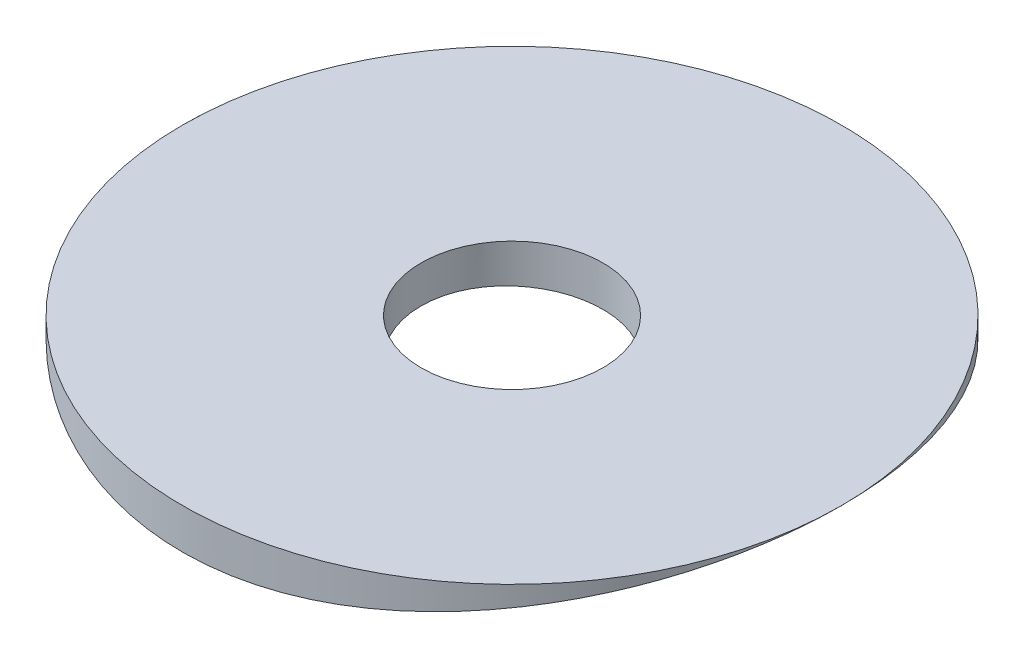
ISO-10303-21;
HEADER;
FILE_DESCRIPTION(('STEP AP214'),'2;1');
FILE_NAME('part.step','',(''),(''),'','','');
FILE_SCHEMA(('AUTOMOTIVE_DESIGN { 1 0 10303 214 1 1 1 1 }'));
ENDSEC;
DATA;
#1=APPLICATION_CONTEXT('core data for automotive mechanical design processes');
#2=APPLICATION_PROTOCOL_DEFINITION('international standard','automotive_design',2000,#1);
#3=PRODUCT_CONTEXT('',#1,'mechanical');
#4=PRODUCT('Part','Part','',(#3));
#5=PRODUCT_RELATED_PRODUCT_CATEGORY('part','',(#4));
#6=PRODUCT_DEFINITION_FORMATION('','',#4);
#7=PRODUCT_DEFINITION_CONTEXT('part definition',#1,'design');
#8=PRODUCT_DEFINITION('design','',#6,#7);
#9=PRODUCT_DEFINITION_SHAPE('','',#8);
#10=(LENGTH_UNIT() NAMED_UNIT(*) SI_UNIT(.MILLI.,.METRE.));
#11=(NAMED_UNIT(*) PLANE_ANGLE_UNIT() SI_UNIT($,.RADIAN.));
#12=(NAMED_UNIT(*) SI_UNIT($,.STERADIAN.) SOLID_ANGLE_UNIT());
#13=UNCERTAINTY_MEASURE_WITH_UNIT(LENGTH_MEASURE(1.E-05),#10,'distance_accuracy_value','');
#14=(GEOMETRIC_REPRESENTATION_CONTEXT(3) GLOBAL_UNCERTAINTY_ASSIGNED_CONTEXT((#13)) GLOBAL_UNIT_ASSIGNED_CONTEXT((#10,
#11,#12)) REPRESENTATION_CONTEXT('',''));
#15=CARTESIAN_POINT('',(0.,0.,0.));
#16=DIRECTION('',(0.,0.,1.));
#17=DIRECTION('',(1.,0.,0.));
#18=AXIS2_PLACEMENT_3D('',#15,#16,#17);
#19=CARTESIAN_POINT('',(-11.5062,-46.2795893867912,23.0124));
#20=DIRECTION('',(0.,-1.,0.));
#21=DIRECTION('',(0.,0.,-1.));
#22=AXIS2_PLACEMENT_3D('',#19,#20,#21);
#23=PLANE('',#22);
#24=CARTESIAN_POINT('',(0.,-46.2795893867912,11.5062));
#25=DIRECTION('',(0.,1.,0.));
#26=DIRECTION('',(0.,0.,1.));
#27=AXIS2_PLACEMENT_3D('',#24,#25,#26);
#28=CIRCLE('',#27,3.175);
#29=CARTESIAN_POINT('',(0.,-46.2795893867912,14.6812));
#30=VERTEX_POINT('',#29);
#31=EDGE_CURVE('E63',#30,#30,#28,.T.);
#32=ORIENTED_EDGE('',*,*,#31,.F.);
#33=EDGE_LOOP('',(#32));
#34=FACE_BOUND('',#33,.T.);
#35=CARTESIAN_POINT('',(0.,-46.2795893867912,11.5062));
#36=DIRECTION('',(0.,1.,0.));
#37=DIRECTION('',(0.,0.,1.));
#38=AXIS2_PLACEMENT_3D('',#35,#36,#37);
#39=CIRCLE('',#38,11.5062);
#40=CARTESIAN_POINT('',(11.5062,-46.2795893867912,11.5062));
#41=VERTEX_POINT('',#40);
#42=CARTESIAN_POINT('',(-11.5062,-46.2795893867912,11.5062));
#43=VERTEX_POINT('',#42);
#44=EDGE_CURVE('E61',#41,#43,#39,.T.);
#45=ORIENTED_EDGE('',*,*,#44,.T.);
#46=EDGE_CURVE('E59',#43,#41,#39,.T.);
#47=ORIENTED_EDGE('',*,*,#46,.T.);
#48=EDGE_LOOP('',(#45,#47));
#49=FACE_BOUND('',#48,.T.);
#50=ADVANCED_FACE('F34',(#34,#49),#23,.F.);
#51=CARTESIAN_POINT('',(0.,-48.8195893867912,11.5062));
#52=DIRECTION('',(0.,1.,0.));
#53=DIRECTION('',(0.,0.,1.));
#54=AXIS2_PLACEMENT_3D('',#51,#52,#53);
#55=CYLINDRICAL_SURFACE('',#54,11.5062);
#56=CARTESIAN_POINT('',(0.,-47.6885,23.0124));
#57=CARTESIAN_POINT('',(0.318246732890627,-47.6884992204809,23.0123985676349));
#58=CARTESIAN_POINT('',(0.636522870128798,-47.6853063120302,22.9991853835495));
#59=CARTESIAN_POINT('',(1.2707825730018,-47.6726210718855,22.9464381079868));
#60=CARTESIAN_POINT('',(1.5867658480226,-47.6631279552842,22.9069007369262));
#61=CARTESIAN_POINT('',(2.21430394956169,-47.638099725689,22.8018078214636));
#62=CARTESIAN_POINT('',(2.52585637579411,-47.6225614581458,22.7362386925078));
#63=CARTESIAN_POINT('',(3.14215313475069,-47.5858719770836,22.5796189306647));
#64=CARTESIAN_POINT('',(3.44689731522977,-47.5647206381818,22.4885677285654));
#65=CARTESIAN_POINT('',(4.0470980682431,-47.5174131320405,22.2818328020855));
#66=CARTESIAN_POINT('',(4.3425652905622,-47.4912629676698,22.166178603749));
#67=CARTESIAN_POINT('',(4.9226005827476,-47.43464935526,21.9110559576735));
#68=CARTESIAN_POINT('',(5.20716858701688,-47.4041858812664,21.7715873666348));
#69=CARTESIAN_POINT('',(5.76348507995101,-47.3397684753857,21.469883592819));
#70=CARTESIAN_POINT('',(6.03523579036861,-47.305815151698,21.3076523752435));
#71=CARTESIAN_POINT('',(6.56431054397245,-47.2353058549203,20.9614863398665));
#72=CARTESIAN_POINT('',(6.82162977460299,-47.1987490227387,20.7775443447765));
#73=CARTESIAN_POINT('',(7.3243912778399,-47.1233705270856,20.3859071791165));
#74=CARTESIAN_POINT('',(7.56955428594153,-47.0845207792537,20.1778588346667));
#75=CARTESIAN_POINT('',(8.04156734729821,-47.0062067679489,19.742037582966));
#76=CARTESIAN_POINT('',(8.26841720353517,-46.9667424978701,19.514264463565));
#77=CARTESIAN_POINT('',(8.70236959779166,-46.8882761451119,19.0404310268405));
#78=CARTESIAN_POINT('',(8.9094666161072,-46.849274194273,18.794365631932));
#79=CARTESIAN_POINT('',(9.30237827348639,-46.7728430362195,18.285701533935));
#80=CARTESIAN_POINT('',(9.48820031852416,-46.7354132846012,18.0231086338254));
#81=CARTESIAN_POINT('',(9.83979101009474,-46.6626642479904,17.4792603382703));
#82=CARTESIAN_POINT('',(10.0052439860227,-46.6273816584643,17.1977958081674));
#83=CARTESIAN_POINT('',(10.3117975603252,-46.5605464857226,16.6214712940022));
#84=CARTESIAN_POINT('',(10.4528978741261,-46.528993946096,16.3266111534561));
#85=CARTESIAN_POINT('',(10.7096289137982,-46.4705737354125,15.7255904877546));
#86=CARTESIAN_POINT('',(10.8252625697344,-46.4437055254747,15.4194312673516));
#87=CARTESIAN_POINT('',(11.0301333046154,-46.3954769363438,14.7979826074268));
#88=CARTESIAN_POINT('',(11.1193709694459,-46.3741164349029,14.4826933707253));
#89=CARTESIAN_POINT('',(11.2692729611225,-46.3379148981606,13.8512866861915));
#90=CARTESIAN_POINT('',(11.3304413451078,-46.3229592050334,13.5352954505988));
#91=CARTESIAN_POINT('',(11.4261124725001,-46.2994537809721,12.8990648218805));
#92=CARTESIAN_POINT('',(11.4606155179418,-46.2909039774795,12.5788254769144));
#93=CARTESIAN_POINT('',(11.5026534678221,-46.280476084,11.9365153898507));
#94=CARTESIAN_POINT('',(11.5101919271719,-46.2785971145551,11.6144448947731));
#95=CARTESIAN_POINT('',(11.4982440398491,-46.2815671212431,10.9708390652864));
#96=CARTESIAN_POINT('',(11.4787580391988,-46.2864160112321,10.649303724078));
#97=CARTESIAN_POINT('',(11.4136748703773,-46.3025068985088,10.016370616729));
#98=CARTESIAN_POINT('',(11.3686748601171,-46.3136026471218,9.70490749902797));
#99=CARTESIAN_POINT('',(11.2533897136348,-46.3417497261994,9.08697734508782));
#100=CARTESIAN_POINT('',(11.1831050133746,-46.3588009539787,8.78051022280235));
#101=CARTESIAN_POINT('',(11.0178100394477,-46.3983631888328,8.17466891463673));
#102=CARTESIAN_POINT('',(10.9227986322931,-46.4208744461954,7.87529505460277));
#103=CARTESIAN_POINT('',(10.7087851942922,-46.4707113415137,7.28566336352624));
#104=CARTESIAN_POINT('',(10.5897828097521,-46.498037050447,6.99540566695418));
#105=CARTESIAN_POINT('',(10.3274317045344,-46.557012610316,6.42320991117423));
#106=CARTESIAN_POINT('',(10.1838631392361,-46.5887009528833,6.1413766426483));
#107=CARTESIAN_POINT('',(9.87421224707139,-46.6553108698528,5.59076779476638));
#108=CARTESIAN_POINT('',(9.70812984095901,-46.6902324556356,5.32199226137658));
#109=CARTESIAN_POINT('',(9.3545741165693,-46.7623514945933,4.79917538520898));
#110=CARTESIAN_POINT('',(9.16709809941159,-46.799549234638,4.54513590754807));
#111=CARTESIAN_POINT('',(8.77201086233625,-46.8752098985855,4.05341924040186));
#112=CARTESIAN_POINT('',(8.56439884531765,-46.9136728725338,3.81574269929488));
#113=CARTESIAN_POINT('',(8.12462470957052,-46.9918576094258,3.35219088072147));
#114=CARTESIAN_POINT('',(7.89195777409035,-47.031585717663,3.12679530740406));
#115=CARTESIAN_POINT('',(7.40836896061007,-47.1101804162462,2.69634771122777));
#116=CARTESIAN_POINT('',(7.15744675041914,-47.1490469908981,2.49129605872732));
#117=CARTESIAN_POINT('',(6.63899973684026,-47.22483813314,2.1029439331515));
#118=CARTESIAN_POINT('',(6.37147409840131,-47.2617626028812,1.91964455543496));
#119=CARTESIAN_POINT('',(5.82162878720429,-47.3326366553632,1.57612674539369));
#120=CARTESIAN_POINT('',(5.53930966095149,-47.3665863478756,1.41590746125616));
#121=CARTESIAN_POINT('',(4.96089851875993,-47.4306591705903,1.11928123169031));
#122=CARTESIAN_POINT('',(4.66476690110639,-47.4607702400527,0.982948858535656));
#123=CARTESIAN_POINT('',(4.0616101251198,-47.5161873496509,0.735769032535113));
#124=CARTESIAN_POINT('',(3.75458491120954,-47.5414933652681,0.624921709731015));
#125=CARTESIAN_POINT('',(3.13189659427401,-47.5865703255751,0.429633991707477));
#126=CARTESIAN_POINT('',(2.81623474855201,-47.6063420712756,0.345189774788329));
#127=CARTESIAN_POINT('',(2.17856508810096,-47.6397817532279,0.203405374918164));
#128=CARTESIAN_POINT('',(1.85655741861773,-47.6534498290138,0.146064572361938));
#129=CARTESIAN_POINT('',(1.21638665838498,-47.6740341595147,0.0600286352011383));
#130=CARTESIAN_POINT('',(0.898316147451562,-47.6811042555896,0.0306804326481103));
#131=CARTESIAN_POINT('',(0.260760575955906,-47.688852597444,-0.00147200626102542));
#132=CARTESIAN_POINT('',(-0.0587244619615724,-47.6895309451797,-0.00427666601900739));
#133=CARTESIAN_POINT('',(-0.696744873146373,-47.684477018652,0.0166805824528598));
#134=CARTESIAN_POINT('',(-1.01528031774418,-47.6787452387183,0.0404404421074679));
#135=CARTESIAN_POINT('',(-1.64910157867821,-47.6610323890382,0.114321384406101));
#136=CARTESIAN_POINT('',(-1.96438740637002,-47.6490513411371,0.164442374900823));
#137=CARTESIAN_POINT('',(-2.58514829611967,-47.6193792741518,0.289759611795546));
#138=CARTESIAN_POINT('',(-2.890698594469,-47.601768755151,0.364602811548358));
#139=CARTESIAN_POINT('',(-3.49432159982125,-47.5612684290336,0.538928586044518));
#140=CARTESIAN_POINT('',(-3.7923943960775,-47.5383786849644,0.638410866535373));
#141=CARTESIAN_POINT('',(-4.37908027566311,-47.4879288869412,0.861259054479426));
#142=CARTESIAN_POINT('',(-4.66769281931577,-47.4603685670974,0.984626321730453));
#143=CARTESIAN_POINT('',(-5.23356431721944,-47.4013056544813,1.25433725391317));
#144=CARTESIAN_POINT('',(-5.51082275214771,-47.3698028816527,1.40068196832793));
#145=CARTESIAN_POINT('',(-6.05674238191884,-47.3031266546319,1.71794970817582));
#146=CARTESIAN_POINT('',(-6.32518172832548,-47.2679005467852,1.8892434234605));
#147=CARTESIAN_POINT('',(-6.84674398695382,-47.1951742599981,2.25331485194512));
#148=CARTESIAN_POINT('',(-7.09986675763358,-47.1576740600491,2.4460927636358));
#149=CARTESIAN_POINT('',(-7.58921288089649,-47.0813999403051,2.85186417044919));
#150=CARTESIAN_POINT('',(-7.82543366041192,-47.0426258278821,3.06486073211512));
#151=CARTESIAN_POINT('',(-8.27941698968223,-46.9648521435315,3.50964587188922));
#152=CARTESIAN_POINT('',(-8.49717974174613,-46.92585257408,3.74143424397546));
#153=CARTESIAN_POINT('',(-8.91757925203087,-46.8478021586205,4.22780202036676));
#154=CARTESIAN_POINT('',(-9.11975827268612,-46.8087703938261,4.48278040295745));
#155=CARTESIAN_POINT('',(-9.50192900495535,-46.7326904240134,5.00914191710173));
#156=CARTESIAN_POINT('',(-9.68192034034236,-46.6956422526361,5.28052532671198));
#157=CARTESIAN_POINT('',(-10.0184103909501,-46.6246079525053,5.83786261516889));
#158=CARTESIAN_POINT('',(-10.1749096907656,-46.5906217475638,6.12381613120392));
#159=CARTESIAN_POINT('',(-10.4632387249786,-46.5267179855457,6.70833909129557));
#160=CARTESIAN_POINT('',(-10.5950687860983,-46.4968003745855,7.00690836820343));
#161=CARTESIAN_POINT('',(-10.8323074675025,-46.4421025470368,7.6127504540477));
#162=CARTESIAN_POINT('',(-10.9378694238564,-46.4172926690481,7.91996051412858));
#163=CARTESIAN_POINT('',(-11.1227281429186,-46.3733435180157,8.54258538392218));
#164=CARTESIAN_POINT('',(-11.2020249468674,-46.3542042360683,8.85800018075136));
#165=CARTESIAN_POINT('',(-11.3336673730964,-46.3221935179297,9.49466533934258));
#166=CARTESIAN_POINT('',(-11.3860175419981,-46.3093210243828,9.81591470717963));
#167=CARTESIAN_POINT('',(-11.463326553472,-46.2902448677587,10.4618869371061));
#168=CARTESIAN_POINT('',(-11.4882860005265,-46.2840410575112,10.7866097223813));
#169=CARTESIAN_POINT('',(-11.5102951239893,-46.278572322594,11.4283598238556));
#170=CARTESIAN_POINT('',(-11.5080729163413,-46.2791263737019,11.7453608564997));
#171=CARTESIAN_POINT('',(-11.477493891953,-46.2867196360727,12.378017208797));
#172=CARTESIAN_POINT('',(-11.4491375671776,-46.2937587252572,12.69367255367));
#173=CARTESIAN_POINT('',(-11.3665313218254,-46.3141101744625,13.3213607751441));
#174=CARTESIAN_POINT('',(-11.3122820212848,-46.3274223842664,13.6333937383039));
#175=CARTESIAN_POINT('',(-11.1783390062078,-46.35992354171,14.2516358964751));
#176=CARTESIAN_POINT('',(-11.0986451663744,-46.3791125182887,14.5578450628004));
#177=CARTESIAN_POINT('',(-10.9149317970956,-46.4226900430481,15.1607450393376));
#178=CARTESIAN_POINT('',(-10.811040696806,-46.4470510816679,15.4574770098489));
#179=CARTESIAN_POINT('',(-10.5795054958695,-46.500335447385,16.0410933477976));
#180=CARTESIAN_POINT('',(-10.4518615472515,-46.5292587452817,16.3279777782497));
#181=CARTESIAN_POINT('',(-10.1737639617234,-46.5908556305375,16.8900151062371));
#182=CARTESIAN_POINT('',(-10.0233121909528,-46.6235289110194,17.1651689612123));
#183=CARTESIAN_POINT('',(-9.70058152391568,-46.6917439317793,17.7021275166934));
#184=CARTESIAN_POINT('',(-9.52829431753712,-46.7272867622691,17.9639270813524));
#185=CARTESIAN_POINT('',(-9.15870480356707,-46.80114855133,18.4785389600204));
#186=CARTESIAN_POINT('',(-8.96090152609513,-46.8395136543902,18.730984983082));
#187=CARTESIAN_POINT('',(-8.54490823163081,-46.9171861260871,19.2185224514448));
#188=CARTESIAN_POINT('',(-8.32670893680021,-46.9564939174349,19.4536059108841));
#189=CARTESIAN_POINT('',(-7.8713864995668,-47.0349622540427,19.9048106680596));
#190=CARTESIAN_POINT('',(-7.63425898743135,-47.0741227631037,20.1209275628936));
#191=CARTESIAN_POINT('',(-7.1427809902973,-47.1511987726748,20.5326074140969));
#192=CARTESIAN_POINT('',(-6.88843824358761,-47.1891148213405,20.728179505832));
#193=CARTESIAN_POINT('',(-6.35962334272006,-47.2633124260529,21.100687951953));
#194=CARTESIAN_POINT('',(-6.08488234154635,-47.2995551992281,21.2772506432863));
#195=CARTESIAN_POINT('',(-5.52117136220328,-47.368663577994,21.6064872886053));
#196=CARTESIAN_POINT('',(-5.2322067437304,-47.4015304414899,21.7591701516719));
#197=CARTESIAN_POINT('',(-4.64209950173224,-47.462952929223,22.0394904535701));
#198=CARTESIAN_POINT('',(-4.34096259027358,-47.4915105465445,22.1671394791246));
#199=CARTESIAN_POINT('',(-3.72855069298149,-47.5435097585458,22.3964439951481));
#200=CARTESIAN_POINT('',(-3.41727732777305,-47.5669521664792,22.4981036180455));
#201=CARTESIAN_POINT('',(-2.85033516676566,-47.6039108816255,22.6568326129536));
#202=CARTESIAN_POINT('',(-2.59608167455876,-47.6184753530549,22.7187583290157));
#203=CARTESIAN_POINT('',(-2.08376286882057,-47.6436429524579,22.8251664487699));
#204=CARTESIAN_POINT('',(-1.82569782815735,-47.6542463625879,22.8696500949161));
#205=CARTESIAN_POINT('',(-1.30697298065937,-47.6712932509188,22.9409280639691));
#206=CARTESIAN_POINT('',(-1.04631291721982,-47.677736313497,22.967720619525));
#207=CARTESIAN_POINT('',(-0.523774998018724,-47.6863394851684,23.0034549945511));
#208=CARTESIAN_POINT('',(-0.261897455727261,-47.6885006414962,23.0124011787482));
#209=CARTESIAN_POINT('',(0.,-47.6885,23.0124));
#210=B_SPLINE_CURVE_WITH_KNOTS('',3,(#56,#57,#58,#59,#60,#61,#62,#63,#64,#65,#66,#67,#68,#69,
#70,#71,#72,#73,#74,#75,#76,#77,#78,#79,#80,#81,#82,#83,#84,#85,#86,#87,#88,#89,#90,#91,#92,#93,
#94,#95,#96,#97,#98,#99,#100,#101,#102,#103,#104,#105,#106,#107,#108,#109,#110,#111,#112,#113,
#114,#115,#116,#117,#118,#119,#120,#121,#122,#123,#124,#125,#126,#127,#128,#129,#130,#131,#132,
#133,#134,#135,#136,#137,#138,#139,#140,#141,#142,#143,#144,#145,#146,#147,#148,#149,#150,#151,
#152,#153,#154,#155,#156,#157,#158,#159,#160,#161,#162,#163,#164,#165,#166,#167,#168,#169,#170,
#171,#172,#173,#174,#175,#176,#177,#178,#179,#180,#181,#182,#183,#184,#185,#186,#187,#188,#189,
#190,#191,#192,#193,#194,#195,#196,#197,#198,#199,#200,#201,#202,#203,#204,#205,#206,#207,#208,
#209),.UNSPECIFIED.,.T.,.F.,(4,2,2,2,2,2,2,2,2,2,2,2,2,2,2,2,2,2,2,2,2,2,2,2,2,2,2,2,2,2,2,2,2,
2,2,2,2,2,2,2,2,2,2,2,2,2,2,2,2,2,2,2,2,2,2,2,2,2,2,2,2,2,2,2,2,2,2,2,2,2,2,2,2,2,2,2,4),(0.,
0.954501893226166,1.90912272476295,2.86424237700186,3.81938336616228,4.77338449327135,
5.72739136114187,6.68123224887051,7.63538935132315,8.60590523797059,9.57643156431278,
10.5472283033895,11.5176860668443,12.5016726507291,13.4856707322319,14.4695555406716,
15.4534185091552,16.4188465395074,17.3842636344253,18.3495534476297,19.3148309013353,
20.2583970571072,21.2019469445707,22.1455400925766,23.0891471527839,24.0416883377546,
24.9942328756441,25.9468977135502,26.8996002789226,27.8775518953703,28.8555213120341,
29.8335399545054,30.8115224921683,31.7925057932145,32.7734940997833,33.7543403480597,
34.7351641723408,35.6925012413669,36.6498230396737,37.6070710173162,38.5643156487763,
39.5084421043505,40.4525572852277,41.396726231405,42.3409383145643,43.3009689245638,
44.2610084049442,45.2211937269521,46.1813685234978,47.1634223941355,48.1454929147449,
49.1275389926611,50.1095720633288,51.0857305939933,52.0618875919308,53.0378798319186,
54.0138505324281,54.9637364328658,55.9136044524274,56.8634497274836,57.8132996799507,
58.7582186957465,59.7031316638485,60.6479673607124,61.5931637282696,62.5610360537939,
63.5293508123764,64.4978897644134,65.4659962106313,66.4505732984387,67.4347821796931,
68.4185344465945,69.40213019517,70.1877961373962,70.9734061039744,71.7590945416053,
72.5445907980859),.UNSPECIFIED.);
#211=EDGE_CURVE('E47',#41,#43,#210,.T.);
#212=ORIENTED_EDGE('',*,*,#211,.T.);
#213=ORIENTED_EDGE('',*,*,#44,.F.);
#214=EDGE_LOOP('',(#212,#213));
#215=FACE_BOUND('',#214,.T.);
#216=ADVANCED_FACE('F67',(#215),#55,.T.);
#217=ORIENTED_EDGE('',*,*,#46,.F.);
#218=EDGE_CURVE('E53',#43,#41,#210,.T.);
#219=ORIENTED_EDGE('',*,*,#218,.T.);
#220=EDGE_LOOP('',(#217,#219));
#221=FACE_BOUND('',#220,.T.);
#222=ADVANCED_FACE('F65',(#221),#55,.T.);
#223=CARTESIAN_POINT('',(0.,0.,23.0124));
#224=DIRECTION('',(0.,0.,-1.));
#225=DIRECTION('',(-1.,0.,0.));
#226=AXIS2_PLACEMENT_3D('',#223,#224,#225);
#227=CYLINDRICAL_SURFACE('',#226,47.6885);
#228=CARTESIAN_POINT('',(0.,-47.6885,14.6812));
#229=CARTESIAN_POINT('',(0.178129464682201,-47.6884985983923,14.6811921716468));
#230=CARTESIAN_POINT('',(0.356383055368182,-47.6874912896571,14.6661590167554));
#231=CARTESIAN_POINT('',(0.707966529549292,-47.6835697779981,14.606405524357));
#232=CARTESIAN_POINT('',(0.881290465814657,-47.6806533659057,14.5616507928849));
#233=CARTESIAN_POINT('',(1.21787115352155,-47.6732435104109,14.4437468309556));
#234=CARTESIAN_POINT('',(1.3811332286456,-47.668750909532,14.370612767951));
#235=CARTESIAN_POINT('',(1.69302205967912,-47.6586937129271,14.1980511982679));
#236=CARTESIAN_POINT('',(1.84165211843303,-47.6531293599671,14.0986296441535));
#237=CARTESIAN_POINT('',(2.12034963580226,-47.641543477738,13.8761329145368));
#238=CARTESIAN_POINT('',(2.25038922987499,-47.6355212824979,13.7530228679073));
#239=CARTESIAN_POINT('',(2.48797599458251,-47.6237041187203,13.4867161295903));
#240=CARTESIAN_POINT('',(2.59552221724273,-47.617909159768,13.3435185917479));
#241=CARTESIAN_POINT('',(2.78515732340433,-47.6071947611636,13.0409412692604));
#242=CARTESIAN_POINT('',(2.86722273426711,-47.6022761305421,12.8815467424374));
#243=CARTESIAN_POINT('',(3.00341655627266,-47.5938778009991,12.5512032984433));
#244=CARTESIAN_POINT('',(3.05754530111357,-47.5903980848901,12.3802545193132));
#245=CARTESIAN_POINT('',(3.13625108129015,-47.5852764087903,12.0319263367162));
#246=CARTESIAN_POINT('',(3.16087220734742,-47.5836317071483,11.8545569366411));
#247=CARTESIAN_POINT('',(3.17999997354824,-47.5823573280138,11.4981958003257));
#248=CARTESIAN_POINT('',(3.17450699351589,-47.5827276251066,11.3192040845758));
#249=CARTESIAN_POINT('',(3.13359902998388,-47.5854389403397,10.9649799618099));
#250=CARTESIAN_POINT('',(3.09823179308924,-47.5877768137745,10.7897420133066));
#251=CARTESIAN_POINT('',(2.99865334204147,-47.5941548786142,10.4476955507445));
#252=CARTESIAN_POINT('',(2.93444193608422,-47.598195081339,10.2808870927472));
#253=CARTESIAN_POINT('',(2.77894379778638,-47.6075261354621,9.96028150644429));
#254=CARTESIAN_POINT('',(2.6876354473883,-47.6128179847425,9.80649489341426));
#255=CARTESIAN_POINT('',(2.48055097848701,-47.6240550114686,9.51641339804095));
#256=CARTESIAN_POINT('',(2.3647745466401,-47.6300001972806,9.38011873973947));
#257=CARTESIAN_POINT('',(2.11177166044706,-47.6418879070646,9.12861229218023));
#258=CARTESIAN_POINT('',(1.97450389212058,-47.6478304033296,9.01344205730632));
#259=CARTESIAN_POINT('',(1.68255957192209,-47.659031972027,8.80777437630301));
#260=CARTESIAN_POINT('',(1.52788301316935,-47.6642910441893,8.71727693992547));
#261=CARTESIAN_POINT('',(1.20548629424639,-47.6735336699595,8.56352710176391));
#262=CARTESIAN_POINT('',(1.03776535916176,-47.6775171477174,8.50027632005674));
#263=CARTESIAN_POINT('',(0.694052323587685,-47.6837587273361,8.40284323837389));
#264=CARTESIAN_POINT('',(0.518060332717272,-47.6860168520568,8.36866055326371));
#265=CARTESIAN_POINT('',(0.163161430090162,-47.6885503346571,8.33038558166807));
#266=CARTESIAN_POINT('',(-0.0157392607318615,-47.688829477656,8.32623585203226));
#267=CARTESIAN_POINT('',(-0.371694109039901,-47.6873836175604,8.34799442919318));
#268=CARTESIAN_POINT('',(-0.548748277443507,-47.6856586263223,8.37390255817066));
#269=CARTESIAN_POINT('',(-0.895822000148099,-47.680401089412,8.45499384454233));
#270=CARTESIAN_POINT('',(-1.06584774984863,-47.6768701740015,8.51015059997761));
#271=CARTESIAN_POINT('',(-1.39422956926831,-47.6683979235374,8.64814660078975));
#272=CARTESIAN_POINT('',(-1.55258552002274,-47.663456574108,8.73098612832374));
#273=CARTESIAN_POINT('',(-1.85339536716782,-47.6527090188861,8.92214206772992));
#274=CARTESIAN_POINT('',(-1.9958248708315,-47.6469015174124,9.03049679093437));
#275=CARTESIAN_POINT('',(-2.26049310024045,-47.6350793937232,9.26955163801912));
#276=CARTESIAN_POINT('',(-2.3827316010535,-47.6290647692012,9.40025201080184));
#277=CARTESIAN_POINT('',(-2.60374293655754,-47.6174952780448,9.68053613619416));
#278=CARTESIAN_POINT('',(-2.70247846655846,-47.6119411513129,9.83014933923933));
#279=CARTESIAN_POINT('',(-2.87342584298463,-47.6019308430942,10.143864389921));
#280=CARTESIAN_POINT('',(-2.94563787078409,-47.5974746540995,10.3079661384717));
#281=CARTESIAN_POINT('',(-3.0614239903229,-47.5901681193181,10.6458644993966));
#282=CARTESIAN_POINT('',(-3.10502144969201,-47.5873164634872,10.8196530750204));
#283=CARTESIAN_POINT('',(-3.16241713776624,-47.5835369665715,11.1721032298247));
#284=CARTESIAN_POINT('',(-3.1762157098313,-47.5826091033195,11.3507647528324));
#285=CARTESIAN_POINT('',(-3.1736185286523,-47.582782369364,11.7075183818366));
#286=CARTESIAN_POINT('',(-3.15728141593345,-47.5838795581481,11.8856109196147));
#287=CARTESIAN_POINT('',(-3.09499831740002,-47.5879709396778,12.2365179374258));
#288=CARTESIAN_POINT('',(-3.04905227916865,-47.5909651357817,12.4093324081144));
#289=CARTESIAN_POINT('',(-2.92886909637586,-47.5985121452103,12.7447856003532));
#290=CARTESIAN_POINT('',(-2.8546323516317,-47.6030649365082,12.9074244656719));
#291=CARTESIAN_POINT('',(-2.67998274398894,-47.6132160494497,13.2179380691714));
#292=CARTESIAN_POINT('',(-2.57957051252143,-47.6188143458718,13.3658131633796));
#293=CARTESIAN_POINT('',(-2.35520235144463,-47.6304383844963,13.6428997487939));
#294=CARTESIAN_POINT('',(-2.2312037455711,-47.6364648889046,13.7720766504064));
#295=CARTESIAN_POINT('',(-1.96324542168783,-47.6482596222419,14.007827537614));
#296=CARTESIAN_POINT('',(-1.8192808369697,-47.6540277877459,14.11439599633));
#297=CARTESIAN_POINT('',(-1.51529393734399,-47.6646626148929,14.3019943041698));
#298=CARTESIAN_POINT('',(-1.35525031212904,-47.6695280551527,14.3829896554164));
#299=CARTESIAN_POINT('',(-1.02391832072713,-47.6777932805234,14.5168594305982));
#300=CARTESIAN_POINT('',(-0.852643345958599,-47.6811947757914,14.569766683576));
#301=CARTESIAN_POINT('',(-0.566939025973481,-47.6852606029892,14.6322551502534));
#302=CARTESIAN_POINT('',(-0.454354934409848,-47.6864699555018,14.6505856215218));
#303=CARTESIAN_POINT('',(-0.227864161010604,-47.6880901017082,14.675060540782));
#304=CARTESIAN_POINT('',(-0.113957481278454,-47.6885008966719,14.6812050081519));
#305=CARTESIAN_POINT('',(0.,-47.6885,14.6812));
#306=B_SPLINE_CURVE_WITH_KNOTS('',3,(#228,#229,#230,#231,#232,#233,#234,#235,#236,#237,#238,
#239,#240,#241,#242,#243,#244,#245,#246,#247,#248,#249,#250,#251,#252,#253,#254,#255,#256,#257,
#258,#259,#260,#261,#262,#263,#264,#265,#266,#267,#268,#269,#270,#271,#272,#273,#274,#275,#276,
#277,#278,#279,#280,#281,#282,#283,#284,#285,#286,#287,#288,#289,#290,#291,#292,#293,#294,#295,
#296,#297,#298,#299,#300,#301,#302,#303,#304,#305),.UNSPECIFIED.,.T.,.F.,(4,2,2,2,2,2,2,2,2,2,2,
2,2,2,2,2,2,2,2,2,2,2,2,2,2,2,2,2,2,2,2,2,2,2,2,2,2,2,4),(0.,0.533972371921444,1.06856373873181,
1.60286978358999,2.13705494314778,2.67203256145305,3.20703272164504,3.74252426576325,
4.27800941338903,4.81269342958934,5.34737070192683,5.88119503837625,6.41502292463221,
6.94927785126184,7.48353962009351,8.01884133384741,8.55414325917763,9.08947700898706,
9.62480366584112,10.1591061478901,10.6934054690755,11.2272233113874,11.7610465948128,
12.2956765887545,12.83031253819,13.3657915039746,13.9012668079546,14.436304278697,
14.9713355843967,15.5053268797068,16.0393191203463,16.5733038146421,17.1072756288207,
17.642222942613,18.1773008797679,18.7130975781012,19.2482666570688,19.5898734959414,
19.9314797915928),.UNSPECIFIED.);
#307=CARTESIAN_POINT('',(0.,-47.6885,14.6812));
#308=VERTEX_POINT('',#307);
#309=EDGE_CURVE('E11',#308,#308,#306,.T.);
#310=ORIENTED_EDGE('',*,*,#309,.T.);
#311=EDGE_LOOP('',(#310));
#312=FACE_BOUND('',#311,.T.);
#313=ORIENTED_EDGE('',*,*,#218,.F.);
#314=ORIENTED_EDGE('',*,*,#211,.F.);
#315=EDGE_LOOP('',(#313,#314));
#316=FACE_BOUND('',#315,.T.);
#317=ADVANCED_FACE('F36',(#312,#316),#227,.T.);
#318=CARTESIAN_POINT('',(0.,-47.6885,11.5062));
#319=DIRECTION('',(0.,1.,0.));
#320=DIRECTION('',(0.,0.,1.));
#321=AXIS2_PLACEMENT_3D('',#318,#319,#320);
#322=CYLINDRICAL_SURFACE('',#321,3.175);
#323=ORIENTED_EDGE('',*,*,#31,.T.);
#324=EDGE_LOOP('',(#323));
#325=FACE_BOUND('',#324,.T.);
#326=ORIENTED_EDGE('',*,*,#309,.F.);
#327=EDGE_LOOP('',(#326));
#328=FACE_BOUND('',#327,.T.);
#329=ADVANCED_FACE('F75',(#325,#328),#322,.F.);
#330=CLOSED_SHELL('',(#50,#216,#222,#317,#329));
#331=MANIFOLD_SOLID_BREP('B2',#330);
#332=ADVANCED_BREP_SHAPE_REPRESENTATION('',(#18,#331),#14);
#333=SHAPE_DEFINITION_REPRESENTATION(#9,#332);
ENDSEC;
END-ISO-10303-21;
